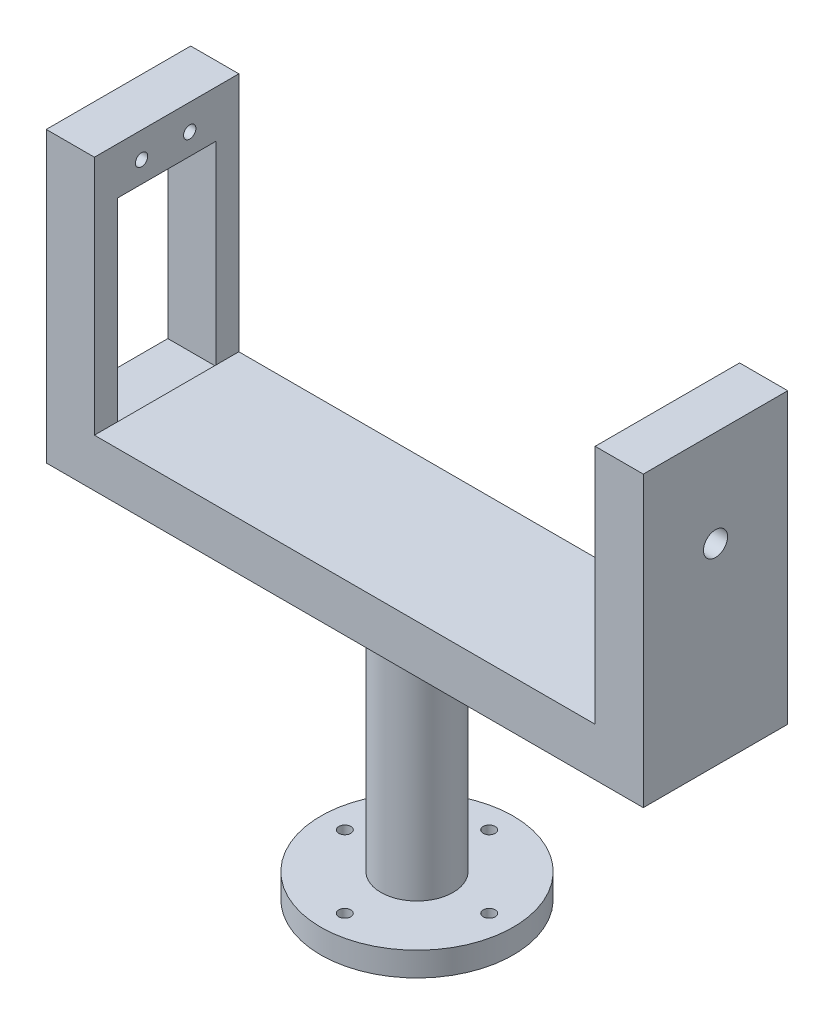
ISO-10303-21;
HEADER;
FILE_DESCRIPTION(('STEP AP214'),'2;1');
FILE_NAME('part.step','',(''),(''),'','','');
FILE_SCHEMA(('AUTOMOTIVE_DESIGN { 1 0 10303 214 1 1 1 1 }'));
ENDSEC;
DATA;
#1=APPLICATION_CONTEXT('core data for automotive mechanical design processes');
#2=APPLICATION_PROTOCOL_DEFINITION('international standard','automotive_design',2000,#1);
#3=PRODUCT_CONTEXT('',#1,'mechanical');
#4=PRODUCT('Part','Part','',(#3));
#5=PRODUCT_RELATED_PRODUCT_CATEGORY('part','',(#4));
#6=PRODUCT_DEFINITION_FORMATION('','',#4);
#7=PRODUCT_DEFINITION_CONTEXT('part definition',#1,'design');
#8=PRODUCT_DEFINITION('design','',#6,#7);
#9=PRODUCT_DEFINITION_SHAPE('','',#8);
#10=(LENGTH_UNIT() NAMED_UNIT(*) SI_UNIT(.MILLI.,.METRE.));
#11=(NAMED_UNIT(*) PLANE_ANGLE_UNIT() SI_UNIT($,.RADIAN.));
#12=(NAMED_UNIT(*) SI_UNIT($,.STERADIAN.) SOLID_ANGLE_UNIT());
#13=UNCERTAINTY_MEASURE_WITH_UNIT(LENGTH_MEASURE(1.E-05),#10,'distance_accuracy_value','');
#14=(GEOMETRIC_REPRESENTATION_CONTEXT(3) GLOBAL_UNCERTAINTY_ASSIGNED_CONTEXT((#13)) GLOBAL_UNIT_ASSIGNED_CONTEXT((#10,
#11,#12)) REPRESENTATION_CONTEXT('',''));
#15=CARTESIAN_POINT('',(0.,0.,0.));
#16=DIRECTION('',(0.,0.,1.));
#17=DIRECTION('',(1.,0.,0.));
#18=AXIS2_PLACEMENT_3D('',#15,#16,#17);
#19=CARTESIAN_POINT('',(-62.,50.,15.));
#20=DIRECTION('',(0.,-1.,0.));
#21=DIRECTION('',(1.,0.,0.));
#22=AXIS2_PLACEMENT_3D('',#19,#20,#21);
#23=PLANE('',#22);
#24=DIRECTION('',(-1.,0.,0.));
#25=VECTOR('',#24,1.);
#26=CARTESIAN_POINT('',(-62.,50.,-15.));
#27=LINE('',#26,#25);
#28=CARTESIAN_POINT('',(-52.,50.,-15.));
#29=VERTEX_POINT('',#28);
#30=CARTESIAN_POINT('',(-62.,50.,-15.));
#31=VERTEX_POINT('',#30);
#32=EDGE_CURVE('E209',#29,#31,#27,.T.);
#33=ORIENTED_EDGE('',*,*,#32,.T.);
#34=DIRECTION('',(0.,0.,-1.));
#35=VECTOR('',#34,1.);
#36=CARTESIAN_POINT('',(-62.,50.,15.));
#37=LINE('',#36,#35);
#38=CARTESIAN_POINT('',(-62.,50.,15.));
#39=VERTEX_POINT('',#38);
#40=EDGE_CURVE('E396',#39,#31,#37,.T.);
#41=ORIENTED_EDGE('',*,*,#40,.F.);
#42=DIRECTION('',(-1.,0.,0.));
#43=VECTOR('',#42,1.);
#44=CARTESIAN_POINT('',(-62.,50.,15.));
#45=LINE('',#44,#43);
#46=CARTESIAN_POINT('',(-52.,50.,15.));
#47=VERTEX_POINT('',#46);
#48=EDGE_CURVE('E190',#47,#39,#45,.T.);
#49=ORIENTED_EDGE('',*,*,#48,.F.);
#50=DIRECTION('',(0.,0.,-1.));
#51=VECTOR('',#50,1.);
#52=CARTESIAN_POINT('',(-52.,50.,15.));
#53=LINE('',#52,#51);
#54=EDGE_CURVE('E174',#47,#29,#53,.T.);
#55=ORIENTED_EDGE('',*,*,#54,.T.);
#56=EDGE_LOOP('',(#33,#41,#49,#55));
#57=FACE_BOUND('',#56,.T.);
#58=ADVANCED_FACE('F39',(#57),#23,.F.);
#59=CARTESIAN_POINT('',(-62.,-10.,15.));
#60=DIRECTION('',(1.,0.,0.));
#61=DIRECTION('',(0.,0.,-1.));
#62=AXIS2_PLACEMENT_3D('',#59,#60,#61);
#63=PLANE('',#62);
#64=CARTESIAN_POINT('',(-62.,-4.537471889078,5.2));
#65=DIRECTION('',(-1.,0.,0.));
#66=DIRECTION('',(0.,0.,1.));
#67=AXIS2_PLACEMENT_3D('',#64,#65,#66);
#68=CIRCLE('',#67,1.28);
#69=CARTESIAN_POINT('',(-62.,-4.537471889078,6.48));
#70=VERTEX_POINT('',#69);
#71=EDGE_CURVE('E305',#70,#70,#68,.T.);
#72=ORIENTED_EDGE('',*,*,#71,.F.);
#73=EDGE_LOOP('',(#72));
#74=FACE_BOUND('',#73,.T.);
#75=CARTESIAN_POINT('',(-62.,-4.537471889078,-4.8));
#76=DIRECTION('',(-1.,0.,0.));
#77=DIRECTION('',(0.,0.,1.));
#78=AXIS2_PLACEMENT_3D('',#75,#76,#77);
#79=CIRCLE('',#78,1.28);
#80=CARTESIAN_POINT('',(-62.,-4.537471889078,-3.52));
#81=VERTEX_POINT('',#80);
#82=EDGE_CURVE('E314',#81,#81,#79,.T.);
#83=ORIENTED_EDGE('',*,*,#82,.F.);
#84=EDGE_LOOP('',(#83));
#85=FACE_BOUND('',#84,.T.);
#86=CARTESIAN_POINT('',(-62.,44.65,5.2));
#87=DIRECTION('',(-1.,0.,0.));
#88=DIRECTION('',(0.,0.,1.));
#89=AXIS2_PLACEMENT_3D('',#86,#87,#88);
#90=CIRCLE('',#89,1.28);
#91=CARTESIAN_POINT('',(-62.,44.65,6.48));
#92=VERTEX_POINT('',#91);
#93=EDGE_CURVE('E322',#92,#92,#90,.T.);
#94=ORIENTED_EDGE('',*,*,#93,.F.);
#95=EDGE_LOOP('',(#94));
#96=FACE_BOUND('',#95,.T.);
#97=CARTESIAN_POINT('',(-62.,44.65,-4.8));
#98=DIRECTION('',(-1.,0.,0.));
#99=DIRECTION('',(0.,0.,1.));
#100=AXIS2_PLACEMENT_3D('',#97,#98,#99);
#101=CIRCLE('',#100,1.28);
#102=CARTESIAN_POINT('',(-62.,44.65,-3.52));
#103=VERTEX_POINT('',#102);
#104=EDGE_CURVE('E330',#103,#103,#101,.T.);
#105=ORIENTED_EDGE('',*,*,#104,.F.);
#106=EDGE_LOOP('',(#105));
#107=FACE_BOUND('',#106,.T.);
#108=DIRECTION('',(0.,0.,-1.));
#109=VECTOR('',#108,1.);
#110=CARTESIAN_POINT('',(-62.,40.25,-10.25));
#111=LINE('',#110,#109);
#112=CARTESIAN_POINT('',(-62.,40.25,10.25));
#113=VERTEX_POINT('',#112);
#114=CARTESIAN_POINT('',(-62.,40.25,-10.25));
#115=VERTEX_POINT('',#114);
#116=EDGE_CURVE('E292',#113,#115,#111,.T.);
#117=ORIENTED_EDGE('',*,*,#116,.F.);
#118=DIRECTION('',(0.,1.,0.));
#119=VECTOR('',#118,1.);
#120=CARTESIAN_POINT('',(-62.,-0.250000000000002,10.25));
#121=LINE('',#120,#119);
#122=CARTESIAN_POINT('',(-62.,-0.250000000000002,10.25));
#123=VERTEX_POINT('',#122);
#124=EDGE_CURVE('E54',#123,#113,#121,.T.);
#125=ORIENTED_EDGE('',*,*,#124,.F.);
#126=DIRECTION('',(0.,0.,1.));
#127=VECTOR('',#126,1.);
#128=CARTESIAN_POINT('',(-62.,-0.250000000000002,-10.25));
#129=LINE('',#128,#127);
#130=CARTESIAN_POINT('',(-62.,-0.250000000000002,-10.25));
#131=VERTEX_POINT('',#130);
#132=EDGE_CURVE('E284',#131,#123,#129,.T.);
#133=ORIENTED_EDGE('',*,*,#132,.F.);
#134=DIRECTION('',(0.,-1.,0.));
#135=VECTOR('',#134,1.);
#136=CARTESIAN_POINT('',(-62.,-0.250000000000002,-10.25));
#137=LINE('',#136,#135);
#138=EDGE_CURVE('E288',#115,#131,#137,.T.);
#139=ORIENTED_EDGE('',*,*,#138,.F.);
#140=EDGE_LOOP('',(#117,#125,#133,#139));
#141=FACE_BOUND('',#140,.T.);
#142=DIRECTION('',(0.,-1.,0.));
#143=VECTOR('',#142,1.);
#144=CARTESIAN_POINT('',(-62.,-10.,-15.));
#145=LINE('',#144,#143);
#146=CARTESIAN_POINT('',(-62.,-10.,-15.));
#147=VERTEX_POINT('',#146);
#148=EDGE_CURVE('E206',#31,#147,#145,.T.);
#149=ORIENTED_EDGE('',*,*,#148,.T.);
#150=DIRECTION('',(0.,0.,-1.));
#151=VECTOR('',#150,1.);
#152=CARTESIAN_POINT('',(-62.,-10.,15.));
#153=LINE('',#152,#151);
#154=CARTESIAN_POINT('',(-62.,-10.,15.));
#155=VERTEX_POINT('',#154);
#156=EDGE_CURVE('E392',#155,#147,#153,.T.);
#157=ORIENTED_EDGE('',*,*,#156,.F.);
#158=DIRECTION('',(0.,-1.,0.));
#159=VECTOR('',#158,1.);
#160=CARTESIAN_POINT('',(-62.,-10.,15.));
#161=LINE('',#160,#159);
#162=EDGE_CURVE('E227',#39,#155,#161,.T.);
#163=ORIENTED_EDGE('',*,*,#162,.F.);
#164=ORIENTED_EDGE('',*,*,#40,.T.);
#165=EDGE_LOOP('',(#149,#157,#163,#164));
#166=FACE_BOUND('',#165,.T.);
#167=ADVANCED_FACE('F407',(#74,#85,#96,#107,#141,#166),#63,.F.);
#168=CARTESIAN_POINT('',(62.,-10.,15.));
#169=DIRECTION('',(0.,1.,0.));
#170=DIRECTION('',(0.,0.,1.));
#171=AXIS2_PLACEMENT_3D('',#168,#169,#170);
#172=PLANE('',#171);
#173=CARTESIAN_POINT('',(0.,-10.,0.));
#174=DIRECTION('',(0.,1.,0.));
#175=DIRECTION('',(0.,0.,1.));
#176=AXIS2_PLACEMENT_3D('',#173,#174,#175);
#177=CIRCLE('',#176,7.5);
#178=CARTESIAN_POINT('',(0.,-10.,7.5));
#179=VERTEX_POINT('',#178);
#180=EDGE_CURVE('E47',#179,#179,#177,.F.);
#181=ORIENTED_EDGE('',*,*,#180,.F.);
#182=EDGE_LOOP('',(#181));
#183=FACE_BOUND('',#182,.T.);
#184=DIRECTION('',(1.,0.,0.));
#185=VECTOR('',#184,1.);
#186=CARTESIAN_POINT('',(62.,-10.,-15.));
#187=LINE('',#186,#185);
#188=CARTESIAN_POINT('',(62.,-10.,-15.));
#189=VERTEX_POINT('',#188);
#190=EDGE_CURVE('E203',#147,#189,#187,.T.);
#191=ORIENTED_EDGE('',*,*,#190,.T.);
#192=DIRECTION('',(0.,0.,-1.));
#193=VECTOR('',#192,1.);
#194=CARTESIAN_POINT('',(62.,-10.,15.));
#195=LINE('',#194,#193);
#196=CARTESIAN_POINT('',(62.,-10.,15.));
#197=VERTEX_POINT('',#196);
#198=EDGE_CURVE('E369',#197,#189,#195,.T.);
#199=ORIENTED_EDGE('',*,*,#198,.F.);
#200=DIRECTION('',(1.,0.,0.));
#201=VECTOR('',#200,1.);
#202=CARTESIAN_POINT('',(62.,-10.,15.));
#203=LINE('',#202,#201);
#204=EDGE_CURVE('E224',#155,#197,#203,.T.);
#205=ORIENTED_EDGE('',*,*,#204,.F.);
#206=ORIENTED_EDGE('',*,*,#156,.T.);
#207=EDGE_LOOP('',(#191,#199,#205,#206));
#208=FACE_BOUND('',#207,.T.);
#209=ADVANCED_FACE('F359',(#183,#208),#172,.F.);
#210=CARTESIAN_POINT('',(62.,50.,15.));
#211=DIRECTION('',(-1.,0.,0.));
#212=DIRECTION('',(0.,-1.,0.));
#213=AXIS2_PLACEMENT_3D('',#210,#211,#212);
#214=PLANE('',#213);
#215=CARTESIAN_POINT('',(62.,30.,0.));
#216=DIRECTION('',(1.,0.,0.));
#217=DIRECTION('',(0.,1.,0.));
#218=AXIS2_PLACEMENT_3D('',#215,#216,#217);
#219=CIRCLE('',#218,2.5);
#220=CARTESIAN_POINT('',(62.,32.5000000000001,0.));
#221=VERTEX_POINT('',#220);
#222=EDGE_CURVE('E337',#221,#221,#219,.T.);
#223=ORIENTED_EDGE('',*,*,#222,.F.);
#224=EDGE_LOOP('',(#223));
#225=FACE_BOUND('',#224,.T.);
#226=DIRECTION('',(0.,1.,0.));
#227=VECTOR('',#226,1.);
#228=CARTESIAN_POINT('',(62.,50.,-15.));
#229=LINE('',#228,#227);
#230=CARTESIAN_POINT('',(62.,50.,-15.));
#231=VERTEX_POINT('',#230);
#232=EDGE_CURVE('E200',#189,#231,#229,.T.);
#233=ORIENTED_EDGE('',*,*,#232,.T.);
#234=DIRECTION('',(0.,0.,-1.));
#235=VECTOR('',#234,1.);
#236=CARTESIAN_POINT('',(62.,50.,15.));
#237=LINE('',#236,#235);
#238=CARTESIAN_POINT('',(62.,50.,15.));
#239=VERTEX_POINT('',#238);
#240=EDGE_CURVE('E366',#239,#231,#237,.T.);
#241=ORIENTED_EDGE('',*,*,#240,.F.);
#242=DIRECTION('',(0.,1.,0.));
#243=VECTOR('',#242,1.);
#244=CARTESIAN_POINT('',(62.,50.,15.));
#245=LINE('',#244,#243);
#246=EDGE_CURVE('E221',#197,#239,#245,.T.);
#247=ORIENTED_EDGE('',*,*,#246,.F.);
#248=ORIENTED_EDGE('',*,*,#198,.T.);
#249=EDGE_LOOP('',(#233,#241,#247,#248));
#250=FACE_BOUND('',#249,.T.);
#251=ADVANCED_FACE('F355',(#225,#250),#214,.F.);
#252=CARTESIAN_POINT('',(52.,50.,15.));
#253=DIRECTION('',(0.,-1.,0.));
#254=DIRECTION('',(0.,0.,-1.));
#255=AXIS2_PLACEMENT_3D('',#252,#253,#254);
#256=PLANE('',#255);
#257=DIRECTION('',(-1.,0.,0.));
#258=VECTOR('',#257,1.);
#259=CARTESIAN_POINT('',(52.,50.,-15.));
#260=LINE('',#259,#258);
#261=CARTESIAN_POINT('',(52.,50.,-15.));
#262=VERTEX_POINT('',#261);
#263=EDGE_CURVE('E197',#231,#262,#260,.T.);
#264=ORIENTED_EDGE('',*,*,#263,.T.);
#265=DIRECTION('',(0.,0.,-1.));
#266=VECTOR('',#265,1.);
#267=CARTESIAN_POINT('',(52.,50.,15.));
#268=LINE('',#267,#266);
#269=CARTESIAN_POINT('',(52.,50.,15.));
#270=VERTEX_POINT('',#269);
#271=EDGE_CURVE('E170',#270,#262,#268,.T.);
#272=ORIENTED_EDGE('',*,*,#271,.F.);
#273=DIRECTION('',(-1.,0.,0.));
#274=VECTOR('',#273,1.);
#275=CARTESIAN_POINT('',(52.,50.,15.));
#276=LINE('',#275,#274);
#277=EDGE_CURVE('E218',#239,#270,#276,.T.);
#278=ORIENTED_EDGE('',*,*,#277,.F.);
#279=ORIENTED_EDGE('',*,*,#240,.T.);
#280=EDGE_LOOP('',(#264,#272,#278,#279));
#281=FACE_BOUND('',#280,.T.);
#282=ADVANCED_FACE('F358',(#281),#256,.F.);
#283=CARTESIAN_POINT('',(52.,0.,15.));
#284=DIRECTION('',(1.,0.,0.));
#285=DIRECTION('',(0.,0.,-1.));
#286=AXIS2_PLACEMENT_3D('',#283,#284,#285);
#287=PLANE('',#286);
#288=CARTESIAN_POINT('',(52.,30.,0.));
#289=DIRECTION('',(1.,0.,0.));
#290=DIRECTION('',(0.,1.,0.));
#291=AXIS2_PLACEMENT_3D('',#288,#289,#290);
#292=CIRCLE('',#291,2.5);
#293=CARTESIAN_POINT('',(52.,32.5,0.));
#294=VERTEX_POINT('',#293);
#295=EDGE_CURVE('E310',#294,#294,#292,.T.);
#296=ORIENTED_EDGE('',*,*,#295,.T.);
#297=EDGE_LOOP('',(#296));
#298=FACE_BOUND('',#297,.T.);
#299=DIRECTION('',(0.,-1.,0.));
#300=VECTOR('',#299,1.);
#301=CARTESIAN_POINT('',(52.,0.,-15.));
#302=LINE('',#301,#300);
#303=CARTESIAN_POINT('',(52.,0.,-15.));
#304=VERTEX_POINT('',#303);
#305=EDGE_CURVE('E194',#262,#304,#302,.T.);
#306=ORIENTED_EDGE('',*,*,#305,.T.);
#307=DIRECTION('',(0.,0.,-1.));
#308=VECTOR('',#307,1.);
#309=CARTESIAN_POINT('',(52.,0.,15.));
#310=LINE('',#309,#308);
#311=CARTESIAN_POINT('',(52.,0.,15.));
#312=VERTEX_POINT('',#311);
#313=EDGE_CURVE('E163',#312,#304,#310,.T.);
#314=ORIENTED_EDGE('',*,*,#313,.F.);
#315=DIRECTION('',(0.,-1.,0.));
#316=VECTOR('',#315,1.);
#317=CARTESIAN_POINT('',(52.,0.,15.));
#318=LINE('',#317,#316);
#319=EDGE_CURVE('E215',#270,#312,#318,.T.);
#320=ORIENTED_EDGE('',*,*,#319,.F.);
#321=ORIENTED_EDGE('',*,*,#271,.T.);
#322=EDGE_LOOP('',(#306,#314,#320,#321));
#323=FACE_BOUND('',#322,.T.);
#324=ADVANCED_FACE('F345',(#298,#323),#287,.F.);
#325=CARTESIAN_POINT('',(-52.,0.,15.));
#326=DIRECTION('',(0.,-1.,0.));
#327=DIRECTION('',(0.,0.,-1.));
#328=AXIS2_PLACEMENT_3D('',#325,#326,#327);
#329=PLANE('',#328);
#330=DIRECTION('',(-1.,0.,0.));
#331=VECTOR('',#330,1.);
#332=CARTESIAN_POINT('',(-52.,0.,-15.));
#333=LINE('',#332,#331);
#334=CARTESIAN_POINT('',(-52.,0.,-15.));
#335=VERTEX_POINT('',#334);
#336=EDGE_CURVE('E191',#304,#335,#333,.T.);
#337=ORIENTED_EDGE('',*,*,#336,.T.);
#338=DIRECTION('',(0.,0.,-1.));
#339=VECTOR('',#338,1.);
#340=CARTESIAN_POINT('',(-52.,0.,15.));
#341=LINE('',#340,#339);
#342=CARTESIAN_POINT('',(-52.,0.,-10.25));
#343=VERTEX_POINT('',#342);
#344=EDGE_CURVE('E166',#343,#335,#341,.T.);
#345=ORIENTED_EDGE('',*,*,#344,.F.);
#346=CARTESIAN_POINT('',(-52.,0.,10.25));
#347=VERTEX_POINT('',#346);
#348=EDGE_CURVE('E164',#347,#343,#341,.T.);
#349=ORIENTED_EDGE('',*,*,#348,.F.);
#350=CARTESIAN_POINT('',(-52.,0.,15.));
#351=VERTEX_POINT('',#350);
#352=EDGE_CURVE('E156',#351,#347,#341,.T.);
#353=ORIENTED_EDGE('',*,*,#352,.F.);
#354=DIRECTION('',(-1.,0.,0.));
#355=VECTOR('',#354,1.);
#356=CARTESIAN_POINT('',(-52.,0.,15.));
#357=LINE('',#356,#355);
#358=EDGE_CURVE('E184',#312,#351,#357,.T.);
#359=ORIENTED_EDGE('',*,*,#358,.F.);
#360=ORIENTED_EDGE('',*,*,#313,.T.);
#361=EDGE_LOOP('',(#337,#345,#349,#353,#359,#360));
#362=FACE_BOUND('',#361,.T.);
#363=ADVANCED_FACE('F384',(#362),#329,.F.);
#364=CARTESIAN_POINT('',(-52.,50.,15.));
#365=DIRECTION('',(-1.,0.,0.));
#366=DIRECTION('',(0.,-1.,0.));
#367=AXIS2_PLACEMENT_3D('',#364,#365,#366);
#368=PLANE('',#367);
#369=CARTESIAN_POINT('',(-52.,44.65,5.2));
#370=DIRECTION('',(-1.,0.,0.));
#371=DIRECTION('',(0.,0.,1.));
#372=AXIS2_PLACEMENT_3D('',#369,#370,#371);
#373=CIRCLE('',#372,1.28);
#374=CARTESIAN_POINT('',(-52.,44.65,6.48));
#375=VERTEX_POINT('',#374);
#376=EDGE_CURVE('E326',#375,#375,#373,.T.);
#377=ORIENTED_EDGE('',*,*,#376,.T.);
#378=EDGE_LOOP('',(#377));
#379=FACE_BOUND('',#378,.T.);
#380=CARTESIAN_POINT('',(-52.,44.65,-4.8));
#381=DIRECTION('',(-1.,0.,0.));
#382=DIRECTION('',(0.,0.,1.));
#383=AXIS2_PLACEMENT_3D('',#380,#381,#382);
#384=CIRCLE('',#383,1.28);
#385=CARTESIAN_POINT('',(-52.,44.65,-3.52));
#386=VERTEX_POINT('',#385);
#387=EDGE_CURVE('E297',#386,#386,#384,.T.);
#388=ORIENTED_EDGE('',*,*,#387,.T.);
#389=EDGE_LOOP('',(#388));
#390=FACE_BOUND('',#389,.T.);
#391=ORIENTED_EDGE('',*,*,#352,.T.);
#392=DIRECTION('',(0.,1.,0.));
#393=VECTOR('',#392,1.);
#394=CARTESIAN_POINT('',(-52.,50.,10.25));
#395=LINE('',#394,#393);
#396=CARTESIAN_POINT('',(-52.,40.25,10.25));
#397=VERTEX_POINT('',#396);
#398=EDGE_CURVE('E11',#347,#397,#395,.T.);
#399=ORIENTED_EDGE('',*,*,#398,.T.);
#400=DIRECTION('',(0.,0.,-1.));
#401=VECTOR('',#400,1.);
#402=CARTESIAN_POINT('',(-52.,40.25,-10.25));
#403=LINE('',#402,#401);
#404=CARTESIAN_POINT('',(-52.,40.25,-10.25));
#405=VERTEX_POINT('',#404);
#406=EDGE_CURVE('E145',#397,#405,#403,.T.);
#407=ORIENTED_EDGE('',*,*,#406,.T.);
#408=DIRECTION('',(0.,-1.,0.));
#409=VECTOR('',#408,1.);
#410=CARTESIAN_POINT('',(-52.,-0.250000000000002,-10.25));
#411=LINE('',#410,#409);
#412=EDGE_CURVE('E62',#405,#343,#411,.T.);
#413=ORIENTED_EDGE('',*,*,#412,.T.);
#414=ORIENTED_EDGE('',*,*,#344,.T.);
#415=DIRECTION('',(0.,1.,0.));
#416=VECTOR('',#415,1.);
#417=CARTESIAN_POINT('',(-52.,50.,-15.));
#418=LINE('',#417,#416);
#419=EDGE_CURVE('E187',#335,#29,#418,.T.);
#420=ORIENTED_EDGE('',*,*,#419,.T.);
#421=ORIENTED_EDGE('',*,*,#54,.F.);
#422=DIRECTION('',(0.,1.,0.));
#423=VECTOR('',#422,1.);
#424=CARTESIAN_POINT('',(-52.,50.,15.));
#425=LINE('',#424,#423);
#426=EDGE_CURVE('E158',#351,#47,#425,.T.);
#427=ORIENTED_EDGE('',*,*,#426,.F.);
#428=EDGE_LOOP('',(#391,#399,#407,#413,#414,#420,#421,#427));
#429=FACE_BOUND('',#428,.T.);
#430=ADVANCED_FACE('F153',(#379,#390,#429),#368,.F.);
#431=CARTESIAN_POINT('',(0.,0.,15.));
#432=DIRECTION('',(0.,0.,-1.));
#433=DIRECTION('',(-1.,0.,0.));
#434=AXIS2_PLACEMENT_3D('',#431,#432,#433);
#435=PLANE('',#434);
#436=ORIENTED_EDGE('',*,*,#48,.T.);
#437=ORIENTED_EDGE('',*,*,#162,.T.);
#438=ORIENTED_EDGE('',*,*,#204,.T.);
#439=ORIENTED_EDGE('',*,*,#246,.T.);
#440=ORIENTED_EDGE('',*,*,#277,.T.);
#441=ORIENTED_EDGE('',*,*,#319,.T.);
#442=ORIENTED_EDGE('',*,*,#358,.T.);
#443=ORIENTED_EDGE('',*,*,#426,.T.);
#444=EDGE_LOOP('',(#436,#437,#438,#439,#440,#441,#442,#443));
#445=FACE_BOUND('',#444,.T.);
#446=ADVANCED_FACE('F386',(#445),#435,.F.);
#447=CARTESIAN_POINT('',(0.,0.,-15.));
#448=DIRECTION('',(0.,0.,-1.));
#449=DIRECTION('',(-1.,0.,0.));
#450=AXIS2_PLACEMENT_3D('',#447,#448,#449);
#451=PLANE('',#450);
#452=ORIENTED_EDGE('',*,*,#32,.F.);
#453=ORIENTED_EDGE('',*,*,#419,.F.);
#454=ORIENTED_EDGE('',*,*,#336,.F.);
#455=ORIENTED_EDGE('',*,*,#305,.F.);
#456=ORIENTED_EDGE('',*,*,#263,.F.);
#457=ORIENTED_EDGE('',*,*,#232,.F.);
#458=ORIENTED_EDGE('',*,*,#190,.F.);
#459=ORIENTED_EDGE('',*,*,#148,.F.);
#460=EDGE_LOOP('',(#452,#453,#454,#455,#456,#457,#458,#459));
#461=FACE_BOUND('',#460,.T.);
#462=ADVANCED_FACE('F379',(#461),#451,.T.);
#463=CARTESIAN_POINT('',(0.,-60.,0.));
#464=DIRECTION('',(0.,1.,0.));
#465=DIRECTION('',(0.,0.,1.));
#466=AXIS2_PLACEMENT_3D('',#463,#464,#465);
#467=CYLINDRICAL_SURFACE('',#466,7.5);
#468=CARTESIAN_POINT('',(0.,-60.,0.));
#469=DIRECTION('',(0.,-1.,0.));
#470=DIRECTION('',(0.,0.,-1.));
#471=AXIS2_PLACEMENT_3D('',#468,#469,#470);
#472=CIRCLE('',#471,7.5);
#473=CARTESIAN_POINT('',(0.,-60.,-7.5));
#474=VERTEX_POINT('',#473);
#475=EDGE_CURVE('E211',#474,#474,#472,.T.);
#476=ORIENTED_EDGE('',*,*,#475,.F.);
#477=EDGE_LOOP('',(#476));
#478=FACE_BOUND('',#477,.T.);
#479=ORIENTED_EDGE('',*,*,#180,.T.);
#480=EDGE_LOOP('',(#479));
#481=FACE_BOUND('',#480,.T.);
#482=ADVANCED_FACE('F403',(#478,#481),#467,.T.);
#483=CARTESIAN_POINT('',(0.,-65.,0.));
#484=DIRECTION('',(0.,-1.,0.));
#485=DIRECTION('',(0.,0.,-1.));
#486=AXIS2_PLACEMENT_3D('',#483,#484,#485);
#487=PLANE('',#486);
#488=CARTESIAN_POINT('',(15.,-65.,0.));
#489=DIRECTION('',(0.,-1.,0.));
#490=DIRECTION('',(0.,0.,1.));
#491=AXIS2_PLACEMENT_3D('',#488,#489,#490);
#492=CIRCLE('',#491,1.25);
#493=CARTESIAN_POINT('',(15.,-65.,1.25));
#494=VERTEX_POINT('',#493);
#495=EDGE_CURVE('E257',#494,#494,#492,.T.);
#496=ORIENTED_EDGE('',*,*,#495,.F.);
#497=EDGE_LOOP('',(#496));
#498=FACE_BOUND('',#497,.T.);
#499=CARTESIAN_POINT('',(0.,-65.,15.));
#500=DIRECTION('',(0.,-1.,0.));
#501=DIRECTION('',(0.,0.,-1.));
#502=AXIS2_PLACEMENT_3D('',#499,#500,#501);
#503=CIRCLE('',#502,1.25);
#504=CARTESIAN_POINT('',(0.,-65.,13.75));
#505=VERTEX_POINT('',#504);
#506=EDGE_CURVE('E241',#505,#505,#503,.T.);
#507=ORIENTED_EDGE('',*,*,#506,.F.);
#508=EDGE_LOOP('',(#507));
#509=FACE_BOUND('',#508,.T.);
#510=CARTESIAN_POINT('',(0.,-65.,0.));
#511=DIRECTION('',(0.,-1.,0.));
#512=DIRECTION('',(0.,0.,-1.));
#513=AXIS2_PLACEMENT_3D('',#510,#511,#512);
#514=CIRCLE('',#513,20.);
#515=CARTESIAN_POINT('',(0.,-65.,-20.));
#516=VERTEX_POINT('',#515);
#517=EDGE_CURVE('E236',#516,#516,#514,.T.);
#518=ORIENTED_EDGE('',*,*,#517,.T.);
#519=EDGE_LOOP('',(#518));
#520=FACE_BOUND('',#519,.T.);
#521=CARTESIAN_POINT('',(-15.,-65.,0.));
#522=DIRECTION('',(0.,-1.,0.));
#523=DIRECTION('',(0.,0.,-1.));
#524=AXIS2_PLACEMENT_3D('',#521,#522,#523);
#525=CIRCLE('',#524,1.25);
#526=CARTESIAN_POINT('',(-15.,-65.,-1.25));
#527=VERTEX_POINT('',#526);
#528=EDGE_CURVE('E249',#527,#527,#525,.T.);
#529=ORIENTED_EDGE('',*,*,#528,.F.);
#530=EDGE_LOOP('',(#529));
#531=FACE_BOUND('',#530,.T.);
#532=CARTESIAN_POINT('',(0.,-65.,-15.));
#533=DIRECTION('',(0.,-1.,0.));
#534=DIRECTION('',(0.,0.,1.));
#535=AXIS2_PLACEMENT_3D('',#532,#533,#534);
#536=CIRCLE('',#535,1.25);
#537=CARTESIAN_POINT('',(0.,-65.,-13.75));
#538=VERTEX_POINT('',#537);
#539=EDGE_CURVE('E265',#538,#538,#536,.T.);
#540=ORIENTED_EDGE('',*,*,#539,.F.);
#541=EDGE_LOOP('',(#540));
#542=FACE_BOUND('',#541,.T.);
#543=ADVANCED_FACE('F438',(#498,#509,#520,#531,#542),#487,.T.);
#544=CARTESIAN_POINT('',(0.,-60.,0.));
#545=DIRECTION('',(0.,-1.,0.));
#546=DIRECTION('',(0.,0.,-1.));
#547=AXIS2_PLACEMENT_3D('',#544,#545,#546);
#548=PLANE('',#547);
#549=ORIENTED_EDGE('',*,*,#475,.T.);
#550=EDGE_LOOP('',(#549));
#551=FACE_BOUND('',#550,.T.);
#552=CARTESIAN_POINT('',(0.,-60.,0.));
#553=DIRECTION('',(0.,-1.,0.));
#554=DIRECTION('',(0.,0.,-1.));
#555=AXIS2_PLACEMENT_3D('',#552,#553,#554);
#556=CIRCLE('',#555,20.);
#557=CARTESIAN_POINT('',(0.,-60.,-20.));
#558=VERTEX_POINT('',#557);
#559=EDGE_CURVE('E237',#558,#558,#556,.T.);
#560=ORIENTED_EDGE('',*,*,#559,.F.);
#561=EDGE_LOOP('',(#560));
#562=FACE_BOUND('',#561,.T.);
#563=CARTESIAN_POINT('',(0.,-60.,15.));
#564=DIRECTION('',(0.,-1.,0.));
#565=DIRECTION('',(0.,0.,-1.));
#566=AXIS2_PLACEMENT_3D('',#563,#564,#565);
#567=CIRCLE('',#566,1.25);
#568=CARTESIAN_POINT('',(0.,-60.,13.75));
#569=VERTEX_POINT('',#568);
#570=EDGE_CURVE('E245',#569,#569,#567,.T.);
#571=ORIENTED_EDGE('',*,*,#570,.T.);
#572=EDGE_LOOP('',(#571));
#573=FACE_BOUND('',#572,.T.);
#574=CARTESIAN_POINT('',(-15.,-60.,0.));
#575=DIRECTION('',(0.,-1.,0.));
#576=DIRECTION('',(0.,0.,-1.));
#577=AXIS2_PLACEMENT_3D('',#574,#575,#576);
#578=CIRCLE('',#577,1.25);
#579=CARTESIAN_POINT('',(-15.,-60.,-1.25));
#580=VERTEX_POINT('',#579);
#581=EDGE_CURVE('E253',#580,#580,#578,.T.);
#582=ORIENTED_EDGE('',*,*,#581,.T.);
#583=EDGE_LOOP('',(#582));
#584=FACE_BOUND('',#583,.T.);
#585=CARTESIAN_POINT('',(15.,-60.,0.));
#586=DIRECTION('',(0.,-1.,0.));
#587=DIRECTION('',(0.,0.,1.));
#588=AXIS2_PLACEMENT_3D('',#585,#586,#587);
#589=CIRCLE('',#588,1.25);
#590=CARTESIAN_POINT('',(15.,-60.,1.25));
#591=VERTEX_POINT('',#590);
#592=EDGE_CURVE('E261',#591,#591,#589,.T.);
#593=ORIENTED_EDGE('',*,*,#592,.T.);
#594=EDGE_LOOP('',(#593));
#595=FACE_BOUND('',#594,.T.);
#596=CARTESIAN_POINT('',(0.,-60.,-15.));
#597=DIRECTION('',(0.,-1.,0.));
#598=DIRECTION('',(0.,0.,1.));
#599=AXIS2_PLACEMENT_3D('',#596,#597,#598);
#600=CIRCLE('',#599,1.25);
#601=CARTESIAN_POINT('',(0.,-60.,-13.75));
#602=VERTEX_POINT('',#601);
#603=EDGE_CURVE('E269',#602,#602,#600,.T.);
#604=ORIENTED_EDGE('',*,*,#603,.T.);
#605=EDGE_LOOP('',(#604));
#606=FACE_BOUND('',#605,.T.);
#607=ADVANCED_FACE('F444',(#551,#562,#573,#584,#595,#606),#548,.F.);
#608=CARTESIAN_POINT('',(0.,-65.,0.));
#609=DIRECTION('',(0.,1.,0.));
#610=DIRECTION('',(0.,0.,1.));
#611=AXIS2_PLACEMENT_3D('',#608,#609,#610);
#612=CYLINDRICAL_SURFACE('',#611,20.);
#613=ORIENTED_EDGE('',*,*,#517,.F.);
#614=EDGE_LOOP('',(#613));
#615=FACE_BOUND('',#614,.T.);
#616=ORIENTED_EDGE('',*,*,#559,.T.);
#617=EDGE_LOOP('',(#616));
#618=FACE_BOUND('',#617,.T.);
#619=ADVANCED_FACE('F440',(#615,#618),#612,.T.);
#620=CARTESIAN_POINT('',(0.,-65.,15.));
#621=DIRECTION('',(0.,1.,0.));
#622=DIRECTION('',(0.,0.,1.));
#623=AXIS2_PLACEMENT_3D('',#620,#621,#622);
#624=CYLINDRICAL_SURFACE('',#623,1.25);
#625=ORIENTED_EDGE('',*,*,#506,.T.);
#626=EDGE_LOOP('',(#625));
#627=FACE_BOUND('',#626,.T.);
#628=ORIENTED_EDGE('',*,*,#570,.F.);
#629=EDGE_LOOP('',(#628));
#630=FACE_BOUND('',#629,.T.);
#631=ADVANCED_FACE('F443',(#627,#630),#624,.F.);
#632=CARTESIAN_POINT('',(-15.,-65.,0.));
#633=DIRECTION('',(0.,1.,0.));
#634=DIRECTION('',(0.,0.,1.));
#635=AXIS2_PLACEMENT_3D('',#632,#633,#634);
#636=CYLINDRICAL_SURFACE('',#635,1.25);
#637=ORIENTED_EDGE('',*,*,#528,.T.);
#638=EDGE_LOOP('',(#637));
#639=FACE_BOUND('',#638,.T.);
#640=ORIENTED_EDGE('',*,*,#581,.F.);
#641=EDGE_LOOP('',(#640));
#642=FACE_BOUND('',#641,.T.);
#643=ADVANCED_FACE('F454',(#639,#642),#636,.F.);
#644=CARTESIAN_POINT('',(15.,-65.,0.));
#645=DIRECTION('',(0.,1.,0.));
#646=DIRECTION('',(0.,0.,1.));
#647=AXIS2_PLACEMENT_3D('',#644,#645,#646);
#648=CYLINDRICAL_SURFACE('',#647,1.25);
#649=ORIENTED_EDGE('',*,*,#495,.T.);
#650=EDGE_LOOP('',(#649));
#651=FACE_BOUND('',#650,.T.);
#652=ORIENTED_EDGE('',*,*,#592,.F.);
#653=EDGE_LOOP('',(#652));
#654=FACE_BOUND('',#653,.T.);
#655=ADVANCED_FACE('F458',(#651,#654),#648,.F.);
#656=CARTESIAN_POINT('',(0.,-65.,-15.));
#657=DIRECTION('',(0.,1.,0.));
#658=DIRECTION('',(0.,0.,1.));
#659=AXIS2_PLACEMENT_3D('',#656,#657,#658);
#660=CYLINDRICAL_SURFACE('',#659,1.25);
#661=ORIENTED_EDGE('',*,*,#539,.T.);
#662=EDGE_LOOP('',(#661));
#663=FACE_BOUND('',#662,.T.);
#664=ORIENTED_EDGE('',*,*,#603,.F.);
#665=EDGE_LOOP('',(#664));
#666=FACE_BOUND('',#665,.T.);
#667=ADVANCED_FACE('F462',(#663,#666),#660,.F.);
#668=CARTESIAN_POINT('',(-52.,0.,0.));
#669=DIRECTION('',(1.,0.,0.));
#670=DIRECTION('',(0.,0.,-1.));
#671=AXIS2_PLACEMENT_3D('',#668,#669,#670);
#672=PLANE('',#671);
#673=CARTESIAN_POINT('',(-52.,-0.250000000000002,-10.25));
#674=VERTEX_POINT('',#673);
#675=EDGE_CURVE('E149',#343,#674,#411,.T.);
#676=ORIENTED_EDGE('',*,*,#675,.T.);
#677=DIRECTION('',(0.,0.,1.));
#678=VECTOR('',#677,1.);
#679=CARTESIAN_POINT('',(-52.,-0.250000000000002,-10.25));
#680=LINE('',#679,#678);
#681=CARTESIAN_POINT('',(-52.,-0.250000000000002,10.25));
#682=VERTEX_POINT('',#681);
#683=EDGE_CURVE('E142',#674,#682,#680,.T.);
#684=ORIENTED_EDGE('',*,*,#683,.T.);
#685=DIRECTION('',(0.,1.,0.));
#686=VECTOR('',#685,1.);
#687=CARTESIAN_POINT('',(-52.,-0.250000000000002,10.25));
#688=LINE('',#687,#686);
#689=EDGE_CURVE('E150',#682,#347,#688,.T.);
#690=ORIENTED_EDGE('',*,*,#689,.T.);
#691=ORIENTED_EDGE('',*,*,#348,.T.);
#692=EDGE_LOOP('',(#676,#684,#690,#691));
#693=FACE_BOUND('',#692,.T.);
#694=ADVANCED_FACE('F466',(#693),#672,.F.);
#695=CARTESIAN_POINT('',(-52.,-0.250000000000002,10.25));
#696=DIRECTION('',(0.,0.,1.));
#697=DIRECTION('',(1.,0.,0.));
#698=AXIS2_PLACEMENT_3D('',#695,#696,#697);
#699=PLANE('',#698);
#700=ORIENTED_EDGE('',*,*,#124,.T.);
#701=DIRECTION('',(-1.,0.,0.));
#702=VECTOR('',#701,1.);
#703=CARTESIAN_POINT('',(-52.,40.25,10.25));
#704=LINE('',#703,#702);
#705=EDGE_CURVE('E132',#397,#113,#704,.T.);
#706=ORIENTED_EDGE('',*,*,#705,.F.);
#707=ORIENTED_EDGE('',*,*,#398,.F.);
#708=ORIENTED_EDGE('',*,*,#689,.F.);
#709=DIRECTION('',(-1.,0.,0.));
#710=VECTOR('',#709,1.);
#711=CARTESIAN_POINT('',(-52.,-0.250000000000002,10.25));
#712=LINE('',#711,#710);
#713=EDGE_CURVE('E273',#682,#123,#712,.T.);
#714=ORIENTED_EDGE('',*,*,#713,.T.);
#715=EDGE_LOOP('',(#700,#706,#707,#708,#714));
#716=FACE_BOUND('',#715,.T.);
#717=ADVANCED_FACE('F134',(#716),#699,.F.);
#718=CARTESIAN_POINT('',(-52.,-0.250000000000002,-10.25));
#719=DIRECTION('',(0.,-1.,0.));
#720=DIRECTION('',(0.,0.,-1.));
#721=AXIS2_PLACEMENT_3D('',#718,#719,#720);
#722=PLANE('',#721);
#723=ORIENTED_EDGE('',*,*,#132,.T.);
#724=ORIENTED_EDGE('',*,*,#713,.F.);
#725=ORIENTED_EDGE('',*,*,#683,.F.);
#726=DIRECTION('',(-1.,0.,0.));
#727=VECTOR('',#726,1.);
#728=CARTESIAN_POINT('',(-52.,-0.250000000000002,-10.25));
#729=LINE('',#728,#727);
#730=EDGE_CURVE('E279',#674,#131,#729,.T.);
#731=ORIENTED_EDGE('',*,*,#730,.T.);
#732=EDGE_LOOP('',(#723,#724,#725,#731));
#733=FACE_BOUND('',#732,.T.);
#734=ADVANCED_FACE('F470',(#733),#722,.F.);
#735=CARTESIAN_POINT('',(-52.,-0.250000000000002,-10.25));
#736=DIRECTION('',(0.,0.,-1.));
#737=DIRECTION('',(-1.,0.,0.));
#738=AXIS2_PLACEMENT_3D('',#735,#736,#737);
#739=PLANE('',#738);
#740=ORIENTED_EDGE('',*,*,#138,.T.);
#741=ORIENTED_EDGE('',*,*,#730,.F.);
#742=ORIENTED_EDGE('',*,*,#675,.F.);
#743=ORIENTED_EDGE('',*,*,#412,.F.);
#744=DIRECTION('',(-1.,0.,0.));
#745=VECTOR('',#744,1.);
#746=CARTESIAN_POINT('',(-52.,40.25,-10.25));
#747=LINE('',#746,#745);
#748=EDGE_CURVE('E141',#405,#115,#747,.T.);
#749=ORIENTED_EDGE('',*,*,#748,.T.);
#750=EDGE_LOOP('',(#740,#741,#742,#743,#749));
#751=FACE_BOUND('',#750,.T.);
#752=ADVANCED_FACE('F474',(#751),#739,.F.);
#753=CARTESIAN_POINT('',(-52.,40.25,-10.25));
#754=DIRECTION('',(0.,1.,0.));
#755=DIRECTION('',(0.,0.,1.));
#756=AXIS2_PLACEMENT_3D('',#753,#754,#755);
#757=PLANE('',#756);
#758=ORIENTED_EDGE('',*,*,#116,.T.);
#759=ORIENTED_EDGE('',*,*,#748,.F.);
#760=ORIENTED_EDGE('',*,*,#406,.F.);
#761=ORIENTED_EDGE('',*,*,#705,.T.);
#762=EDGE_LOOP('',(#758,#759,#760,#761));
#763=FACE_BOUND('',#762,.T.);
#764=ADVANCED_FACE('F146',(#763),#757,.F.);
#765=CARTESIAN_POINT('',(-52.,44.65,-4.8));
#766=DIRECTION('',(-1.,0.,0.));
#767=DIRECTION('',(0.,0.,1.));
#768=AXIS2_PLACEMENT_3D('',#765,#766,#767);
#769=CYLINDRICAL_SURFACE('',#768,1.28);
#770=ORIENTED_EDGE('',*,*,#387,.F.);
#771=EDGE_LOOP('',(#770));
#772=FACE_BOUND('',#771,.T.);
#773=ORIENTED_EDGE('',*,*,#104,.T.);
#774=EDGE_LOOP('',(#773));
#775=FACE_BOUND('',#774,.T.);
#776=ADVANCED_FACE('F473',(#772,#775),#769,.F.);
#777=CARTESIAN_POINT('',(-52.,44.65,5.2));
#778=DIRECTION('',(-1.,0.,0.));
#779=DIRECTION('',(0.,0.,1.));
#780=AXIS2_PLACEMENT_3D('',#777,#778,#779);
#781=CYLINDRICAL_SURFACE('',#780,1.28);
#782=ORIENTED_EDGE('',*,*,#376,.F.);
#783=EDGE_LOOP('',(#782));
#784=FACE_BOUND('',#783,.T.);
#785=ORIENTED_EDGE('',*,*,#93,.T.);
#786=EDGE_LOOP('',(#785));
#787=FACE_BOUND('',#786,.T.);
#788=ADVANCED_FACE('F494',(#784,#787),#781,.F.);
#789=CARTESIAN_POINT('',(-52.,-4.537471889078,-4.8));
#790=DIRECTION('',(-1.,0.,0.));
#791=DIRECTION('',(0.,0.,1.));
#792=AXIS2_PLACEMENT_3D('',#789,#790,#791);
#793=CYLINDRICAL_SURFACE('',#792,1.28);
#794=CARTESIAN_POINT('',(-52.,-4.537471889078,-4.8));
#795=DIRECTION('',(-1.,0.,0.));
#796=DIRECTION('',(0.,0.,1.));
#797=AXIS2_PLACEMENT_3D('',#794,#795,#796);
#798=CIRCLE('',#797,1.28);
#799=CARTESIAN_POINT('',(-52.,-4.537471889078,-3.52));
#800=VERTEX_POINT('',#799);
#801=EDGE_CURVE('E318',#800,#800,#798,.T.);
#802=ORIENTED_EDGE('',*,*,#801,.F.);
#803=EDGE_LOOP('',(#802));
#804=FACE_BOUND('',#803,.T.);
#805=ORIENTED_EDGE('',*,*,#82,.T.);
#806=EDGE_LOOP('',(#805));
#807=FACE_BOUND('',#806,.T.);
#808=ADVANCED_FACE('F491',(#804,#807),#793,.F.);
#809=CARTESIAN_POINT('',(-52.,-4.537471889078,-4.8));
#810=DIRECTION('',(-1.,0.,0.));
#811=DIRECTION('',(0.,0.,1.));
#812=AXIS2_PLACEMENT_3D('',#809,#810,#811);
#813=PLANE('',#812);
#814=ORIENTED_EDGE('',*,*,#801,.T.);
#815=EDGE_LOOP('',(#814));
#816=FACE_BOUND('',#815,.T.);
#817=ADVANCED_FACE('F486',(#816),#813,.T.);
#818=CARTESIAN_POINT('',(-52.,-4.537471889078,5.2));
#819=DIRECTION('',(-1.,0.,0.));
#820=DIRECTION('',(0.,0.,1.));
#821=AXIS2_PLACEMENT_3D('',#818,#819,#820);
#822=CYLINDRICAL_SURFACE('',#821,1.28);
#823=CARTESIAN_POINT('',(-52.,-4.537471889078,5.2));
#824=DIRECTION('',(-1.,0.,0.));
#825=DIRECTION('',(0.,0.,1.));
#826=AXIS2_PLACEMENT_3D('',#823,#824,#825);
#827=CIRCLE('',#826,1.28);
#828=CARTESIAN_POINT('',(-52.,-4.537471889078,6.48));
#829=VERTEX_POINT('',#828);
#830=EDGE_CURVE('E309',#829,#829,#827,.T.);
#831=ORIENTED_EDGE('',*,*,#830,.F.);
#832=EDGE_LOOP('',(#831));
#833=FACE_BOUND('',#832,.T.);
#834=ORIENTED_EDGE('',*,*,#71,.T.);
#835=EDGE_LOOP('',(#834));
#836=FACE_BOUND('',#835,.T.);
#837=ADVANCED_FACE('F483',(#833,#836),#822,.F.);
#838=CARTESIAN_POINT('',(-52.,-4.537471889078,5.2));
#839=DIRECTION('',(-1.,0.,0.));
#840=DIRECTION('',(0.,0.,1.));
#841=AXIS2_PLACEMENT_3D('',#838,#839,#840);
#842=PLANE('',#841);
#843=ORIENTED_EDGE('',*,*,#830,.T.);
#844=EDGE_LOOP('',(#843));
#845=FACE_BOUND('',#844,.T.);
#846=ADVANCED_FACE('F351',(#845),#842,.T.);
#847=CARTESIAN_POINT('',(52.,30.,0.));
#848=DIRECTION('',(1.,0.,0.));
#849=DIRECTION('',(0.,1.,0.));
#850=AXIS2_PLACEMENT_3D('',#847,#848,#849);
#851=CYLINDRICAL_SURFACE('',#850,2.5);
#852=ORIENTED_EDGE('',*,*,#295,.F.);
#853=EDGE_LOOP('',(#852));
#854=FACE_BOUND('',#853,.T.);
#855=ORIENTED_EDGE('',*,*,#222,.T.);
#856=EDGE_LOOP('',(#855));
#857=FACE_BOUND('',#856,.T.);
#858=ADVANCED_FACE('F348',(#854,#857),#851,.F.);
#859=CLOSED_SHELL('',(#58,#167,#209,#251,#282,#324,#363,#430,#446,#462,#482,#543,#607,#619,#631,
#643,#655,#667,#694,#717,#734,#752,#764,#776,#788,#808,#817,#837,#846,#858));
#860=MANIFOLD_SOLID_BREP('B2',#859);
#861=ADVANCED_BREP_SHAPE_REPRESENTATION('',(#18,#860),#14);
#862=SHAPE_DEFINITION_REPRESENTATION(#9,#861);
ENDSEC;
END-ISO-10303-21;
